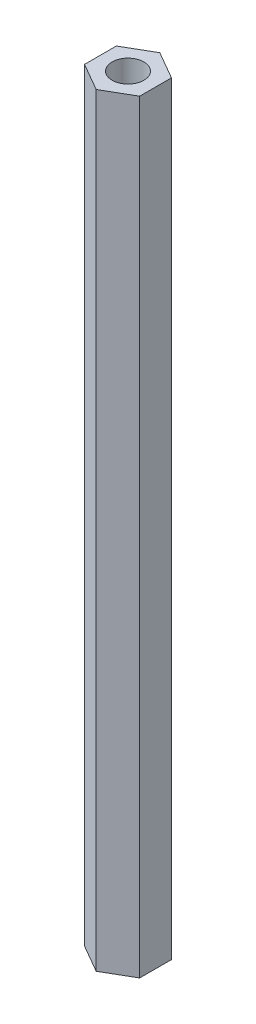
ISO-10303-21;
HEADER;
FILE_DESCRIPTION(('STEP AP214'),'2;1');
FILE_NAME('part.step','',(''),(''),'','','');
FILE_SCHEMA(('AUTOMOTIVE_DESIGN { 1 0 10303 214 1 1 1 1 }'));
ENDSEC;
DATA;
#1=APPLICATION_CONTEXT('core data for automotive mechanical design processes');
#2=APPLICATION_PROTOCOL_DEFINITION('international standard','automotive_design',2000,#1);
#3=PRODUCT_CONTEXT('',#1,'mechanical');
#4=PRODUCT('Part','Part','',(#3));
#5=PRODUCT_RELATED_PRODUCT_CATEGORY('part','',(#4));
#6=PRODUCT_DEFINITION_FORMATION('','',#4);
#7=PRODUCT_DEFINITION_CONTEXT('part definition',#1,'design');
#8=PRODUCT_DEFINITION('design','',#6,#7);
#9=PRODUCT_DEFINITION_SHAPE('','',#8);
#10=(LENGTH_UNIT() NAMED_UNIT(*) SI_UNIT(.MILLI.,.METRE.));
#11=(NAMED_UNIT(*) PLANE_ANGLE_UNIT() SI_UNIT($,.RADIAN.));
#12=(NAMED_UNIT(*) SI_UNIT($,.STERADIAN.) SOLID_ANGLE_UNIT());
#13=UNCERTAINTY_MEASURE_WITH_UNIT(LENGTH_MEASURE(1.E-05),#10,'distance_accuracy_value','');
#14=(GEOMETRIC_REPRESENTATION_CONTEXT(3) GLOBAL_UNCERTAINTY_ASSIGNED_CONTEXT((#13)) GLOBAL_UNIT_ASSIGNED_CONTEXT((#10,
#11,#12)) REPRESENTATION_CONTEXT('',''));
#15=CARTESIAN_POINT('',(0.,0.,0.));
#16=DIRECTION('',(0.,0.,1.));
#17=DIRECTION('',(1.,0.,0.));
#18=AXIS2_PLACEMENT_3D('',#15,#16,#17);
#19=CARTESIAN_POINT('',(0.,120.,-5.));
#20=DIRECTION('',(0.,1.,0.));
#21=DIRECTION('',(0.,0.,1.));
#22=AXIS2_PLACEMENT_3D('',#19,#20,#21);
#23=PLANE('',#22);
#24=DIRECTION('',(-0.866025403784439,0.,-0.5));
#25=VECTOR('',#24,1.);
#26=CARTESIAN_POINT('',(4.33012701892219,120.,-2.5));
#27=LINE('',#26,#25);
#28=CARTESIAN_POINT('',(4.33012701892219,120.,-2.5));
#29=VERTEX_POINT('',#28);
#30=CARTESIAN_POINT('',(0.,120.,-5.));
#31=VERTEX_POINT('',#30);
#32=EDGE_CURVE('E127',#29,#31,#27,.T.);
#33=ORIENTED_EDGE('',*,*,#32,.T.);
#34=DIRECTION('',(-0.866025403784439,0.,0.5));
#35=VECTOR('',#34,1.);
#36=CARTESIAN_POINT('',(0.,120.,-5.));
#37=LINE('',#36,#35);
#38=CARTESIAN_POINT('',(-4.33012701892219,120.,-2.5));
#39=VERTEX_POINT('',#38);
#40=EDGE_CURVE('E85',#31,#39,#37,.T.);
#41=ORIENTED_EDGE('',*,*,#40,.T.);
#42=DIRECTION('',(0.,0.,1.));
#43=VECTOR('',#42,1.);
#44=CARTESIAN_POINT('',(-4.33012701892219,120.,-2.5));
#45=LINE('',#44,#43);
#46=CARTESIAN_POINT('',(-4.33012701892219,120.,2.5));
#47=VERTEX_POINT('',#46);
#48=EDGE_CURVE('E98',#39,#47,#45,.T.);
#49=ORIENTED_EDGE('',*,*,#48,.T.);
#50=DIRECTION('',(0.866025403784439,0.,0.5));
#51=VECTOR('',#50,1.);
#52=CARTESIAN_POINT('',(-4.33012701892219,120.,2.5));
#53=LINE('',#52,#51);
#54=CARTESIAN_POINT('',(0.,120.,5.));
#55=VERTEX_POINT('',#54);
#56=EDGE_CURVE('E92',#47,#55,#53,.T.);
#57=ORIENTED_EDGE('',*,*,#56,.T.);
#58=DIRECTION('',(0.866025403784439,0.,-0.5));
#59=VECTOR('',#58,1.);
#60=CARTESIAN_POINT('',(0.,120.,5.));
#61=LINE('',#60,#59);
#62=CARTESIAN_POINT('',(4.33012701892219,120.,2.5));
#63=VERTEX_POINT('',#62);
#64=EDGE_CURVE('E96',#55,#63,#61,.T.);
#65=ORIENTED_EDGE('',*,*,#64,.T.);
#66=DIRECTION('',(0.,0.,-1.));
#67=VECTOR('',#66,1.);
#68=CARTESIAN_POINT('',(4.33012701892219,120.,2.5));
#69=LINE('',#68,#67);
#70=EDGE_CURVE('E48',#63,#29,#69,.T.);
#71=ORIENTED_EDGE('',*,*,#70,.T.);
#72=EDGE_LOOP('',(#33,#41,#49,#57,#65,#71));
#73=FACE_BOUND('',#72,.T.);
#74=CARTESIAN_POINT('',(0.,120.,0.));
#75=DIRECTION('',(0.,1.,0.));
#76=DIRECTION('',(0.,0.,1.));
#77=AXIS2_PLACEMENT_3D('',#74,#75,#76);
#78=CIRCLE('',#77,2.5);
#79=CARTESIAN_POINT('',(0.,120.,2.5));
#80=VERTEX_POINT('',#79);
#81=EDGE_CURVE('E120',#80,#80,#78,.T.);
#82=ORIENTED_EDGE('',*,*,#81,.F.);
#83=EDGE_LOOP('',(#82));
#84=FACE_BOUND('',#83,.T.);
#85=ADVANCED_FACE('F31',(#73,#84),#23,.T.);
#86=CARTESIAN_POINT('',(0.,0.,-5.));
#87=DIRECTION('',(0.,1.,0.));
#88=DIRECTION('',(0.,0.,1.));
#89=AXIS2_PLACEMENT_3D('',#86,#87,#88);
#90=PLANE('',#89);
#91=DIRECTION('',(-0.866025403784439,0.,-0.5));
#92=VECTOR('',#91,1.);
#93=CARTESIAN_POINT('',(4.33012701892219,0.,-2.5));
#94=LINE('',#93,#92);
#95=CARTESIAN_POINT('',(4.33012701892219,0.,-2.5));
#96=VERTEX_POINT('',#95);
#97=CARTESIAN_POINT('',(0.,0.,-5.));
#98=VERTEX_POINT('',#97);
#99=EDGE_CURVE('E116',#96,#98,#94,.T.);
#100=ORIENTED_EDGE('',*,*,#99,.F.);
#101=DIRECTION('',(0.,0.,-1.));
#102=VECTOR('',#101,1.);
#103=CARTESIAN_POINT('',(4.33012701892219,0.,2.5));
#104=LINE('',#103,#102);
#105=CARTESIAN_POINT('',(4.33012701892219,0.,2.5));
#106=VERTEX_POINT('',#105);
#107=EDGE_CURVE('E77',#106,#96,#104,.T.);
#108=ORIENTED_EDGE('',*,*,#107,.F.);
#109=DIRECTION('',(0.866025403784439,0.,-0.5));
#110=VECTOR('',#109,1.);
#111=CARTESIAN_POINT('',(0.,0.,5.));
#112=LINE('',#111,#110);
#113=CARTESIAN_POINT('',(0.,0.,5.));
#114=VERTEX_POINT('',#113);
#115=EDGE_CURVE('E71',#114,#106,#112,.T.);
#116=ORIENTED_EDGE('',*,*,#115,.F.);
#117=DIRECTION('',(0.866025403784439,0.,0.5));
#118=VECTOR('',#117,1.);
#119=CARTESIAN_POINT('',(-4.33012701892219,0.,2.5));
#120=LINE('',#119,#118);
#121=CARTESIAN_POINT('',(-4.33012701892219,0.,2.5));
#122=VERTEX_POINT('',#121);
#123=EDGE_CURVE('E106',#122,#114,#120,.T.);
#124=ORIENTED_EDGE('',*,*,#123,.F.);
#125=DIRECTION('',(0.,0.,1.));
#126=VECTOR('',#125,1.);
#127=CARTESIAN_POINT('',(-4.33012701892219,0.,-2.5));
#128=LINE('',#127,#126);
#129=CARTESIAN_POINT('',(-4.33012701892219,0.,-2.5));
#130=VERTEX_POINT('',#129);
#131=EDGE_CURVE('E122',#130,#122,#128,.T.);
#132=ORIENTED_EDGE('',*,*,#131,.F.);
#133=DIRECTION('',(-0.866025403784439,0.,0.5));
#134=VECTOR('',#133,1.);
#135=CARTESIAN_POINT('',(0.,0.,-5.));
#136=LINE('',#135,#134);
#137=EDGE_CURVE('E119',#98,#130,#136,.T.);
#138=ORIENTED_EDGE('',*,*,#137,.F.);
#139=EDGE_LOOP('',(#100,#108,#116,#124,#132,#138));
#140=FACE_BOUND('',#139,.T.);
#141=CARTESIAN_POINT('',(0.,0.,0.));
#142=DIRECTION('',(0.,1.,0.));
#143=DIRECTION('',(0.,0.,1.));
#144=AXIS2_PLACEMENT_3D('',#141,#142,#143);
#145=CIRCLE('',#144,2.5);
#146=CARTESIAN_POINT('',(0.,0.,2.5));
#147=VERTEX_POINT('',#146);
#148=EDGE_CURVE('E220',#147,#147,#145,.T.);
#149=ORIENTED_EDGE('',*,*,#148,.T.);
#150=EDGE_LOOP('',(#149));
#151=FACE_BOUND('',#150,.T.);
#152=ADVANCED_FACE('F136',(#140,#151),#90,.F.);
#153=CARTESIAN_POINT('',(4.33012701892219,120.,-2.5));
#154=DIRECTION('',(-0.5,0.,0.866025403784439));
#155=DIRECTION('',(0.866025403784439,0.,0.5));
#156=AXIS2_PLACEMENT_3D('',#153,#154,#155);
#157=PLANE('',#156);
#158=ORIENTED_EDGE('',*,*,#99,.T.);
#159=DIRECTION('',(0.,-1.,0.));
#160=VECTOR('',#159,1.);
#161=CARTESIAN_POINT('',(0.,120.,-5.));
#162=LINE('',#161,#160);
#163=EDGE_CURVE('E11',#31,#98,#162,.T.);
#164=ORIENTED_EDGE('',*,*,#163,.F.);
#165=ORIENTED_EDGE('',*,*,#32,.F.);
#166=DIRECTION('',(0.,-1.,0.));
#167=VECTOR('',#166,1.);
#168=CARTESIAN_POINT('',(4.33012701892219,120.,-2.5));
#169=LINE('',#168,#167);
#170=EDGE_CURVE('E112',#29,#96,#169,.T.);
#171=ORIENTED_EDGE('',*,*,#170,.T.);
#172=EDGE_LOOP('',(#158,#164,#165,#171));
#173=FACE_BOUND('',#172,.T.);
#174=ADVANCED_FACE('F33',(#173),#157,.F.);
#175=CARTESIAN_POINT('',(0.,120.,-5.));
#176=DIRECTION('',(0.5,0.,0.866025403784439));
#177=DIRECTION('',(0.866025403784439,0.,-0.5));
#178=AXIS2_PLACEMENT_3D('',#175,#176,#177);
#179=PLANE('',#178);
#180=ORIENTED_EDGE('',*,*,#137,.T.);
#181=DIRECTION('',(0.,-1.,0.));
#182=VECTOR('',#181,1.);
#183=CARTESIAN_POINT('',(-4.33012701892219,120.,-2.5));
#184=LINE('',#183,#182);
#185=EDGE_CURVE('E40',#39,#130,#184,.T.);
#186=ORIENTED_EDGE('',*,*,#185,.F.);
#187=ORIENTED_EDGE('',*,*,#40,.F.);
#188=ORIENTED_EDGE('',*,*,#163,.T.);
#189=EDGE_LOOP('',(#180,#186,#187,#188));
#190=FACE_BOUND('',#189,.T.);
#191=ADVANCED_FACE('F161',(#190),#179,.F.);
#192=CARTESIAN_POINT('',(-4.33012701892219,120.,-2.5));
#193=DIRECTION('',(1.,0.,0.));
#194=DIRECTION('',(0.,0.,-1.));
#195=AXIS2_PLACEMENT_3D('',#192,#193,#194);
#196=PLANE('',#195);
#197=ORIENTED_EDGE('',*,*,#131,.T.);
#198=DIRECTION('',(0.,-1.,0.));
#199=VECTOR('',#198,1.);
#200=CARTESIAN_POINT('',(-4.33012701892219,120.,2.5));
#201=LINE('',#200,#199);
#202=EDGE_CURVE('E107',#47,#122,#201,.T.);
#203=ORIENTED_EDGE('',*,*,#202,.F.);
#204=ORIENTED_EDGE('',*,*,#48,.F.);
#205=ORIENTED_EDGE('',*,*,#185,.T.);
#206=EDGE_LOOP('',(#197,#203,#204,#205));
#207=FACE_BOUND('',#206,.T.);
#208=ADVANCED_FACE('F133',(#207),#196,.F.);
#209=CARTESIAN_POINT('',(-4.33012701892219,120.,2.5));
#210=DIRECTION('',(0.5,0.,-0.866025403784439));
#211=DIRECTION('',(-0.866025403784439,0.,-0.5));
#212=AXIS2_PLACEMENT_3D('',#209,#210,#211);
#213=PLANE('',#212);
#214=ORIENTED_EDGE('',*,*,#123,.T.);
#215=DIRECTION('',(0.,-1.,0.));
#216=VECTOR('',#215,1.);
#217=CARTESIAN_POINT('',(0.,120.,5.));
#218=LINE('',#217,#216);
#219=EDGE_CURVE('E103',#55,#114,#218,.T.);
#220=ORIENTED_EDGE('',*,*,#219,.F.);
#221=ORIENTED_EDGE('',*,*,#56,.F.);
#222=ORIENTED_EDGE('',*,*,#202,.T.);
#223=EDGE_LOOP('',(#214,#220,#221,#222));
#224=FACE_BOUND('',#223,.T.);
#225=ADVANCED_FACE('F104',(#224),#213,.F.);
#226=CARTESIAN_POINT('',(0.,120.,5.));
#227=DIRECTION('',(-0.5,0.,-0.866025403784439));
#228=DIRECTION('',(-0.866025403784439,0.,0.5));
#229=AXIS2_PLACEMENT_3D('',#226,#227,#228);
#230=PLANE('',#229);
#231=ORIENTED_EDGE('',*,*,#115,.T.);
#232=DIRECTION('',(0.,-1.,0.));
#233=VECTOR('',#232,1.);
#234=CARTESIAN_POINT('',(4.33012701892219,120.,2.5));
#235=LINE('',#234,#233);
#236=EDGE_CURVE('E108',#63,#106,#235,.T.);
#237=ORIENTED_EDGE('',*,*,#236,.F.);
#238=ORIENTED_EDGE('',*,*,#64,.F.);
#239=ORIENTED_EDGE('',*,*,#219,.T.);
#240=EDGE_LOOP('',(#231,#237,#238,#239));
#241=FACE_BOUND('',#240,.T.);
#242=ADVANCED_FACE('F110',(#241),#230,.F.);
#243=CARTESIAN_POINT('',(4.33012701892219,120.,2.5));
#244=DIRECTION('',(-1.,0.,0.));
#245=DIRECTION('',(0.,0.,1.));
#246=AXIS2_PLACEMENT_3D('',#243,#244,#245);
#247=PLANE('',#246);
#248=ORIENTED_EDGE('',*,*,#107,.T.);
#249=ORIENTED_EDGE('',*,*,#170,.F.);
#250=ORIENTED_EDGE('',*,*,#70,.F.);
#251=ORIENTED_EDGE('',*,*,#236,.T.);
#252=EDGE_LOOP('',(#248,#249,#250,#251));
#253=FACE_BOUND('',#252,.T.);
#254=ADVANCED_FACE('F141',(#253),#247,.F.);
#255=CARTESIAN_POINT('',(0.,120.,0.));
#256=DIRECTION('',(0.,-1.,0.));
#257=DIRECTION('',(0.,0.,-1.));
#258=AXIS2_PLACEMENT_3D('',#255,#256,#257);
#259=CYLINDRICAL_SURFACE('',#258,2.5);
#260=ORIENTED_EDGE('',*,*,#81,.T.);
#261=EDGE_LOOP('',(#260));
#262=FACE_BOUND('',#261,.T.);
#263=ORIENTED_EDGE('',*,*,#148,.F.);
#264=EDGE_LOOP('',(#263));
#265=FACE_BOUND('',#264,.T.);
#266=ADVANCED_FACE('F143',(#262,#265),#259,.F.);
#267=CLOSED_SHELL('',(#85,#152,#174,#191,#208,#225,#242,#254,#266));
#268=MANIFOLD_SOLID_BREP('B2',#267);
#269=ADVANCED_BREP_SHAPE_REPRESENTATION('',(#18,#268),#14);
#270=SHAPE_DEFINITION_REPRESENTATION(#9,#269);
ENDSEC;
END-ISO-10303-21;
